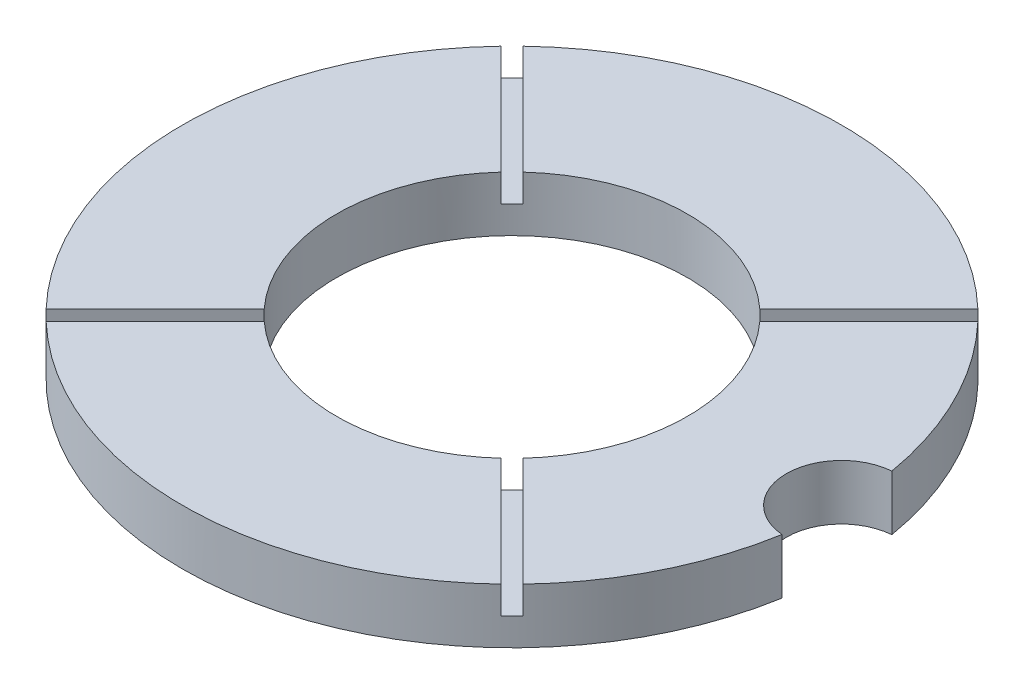
ISO-10303-21;
HEADER;
FILE_DESCRIPTION(('STEP AP214'),'2;1');
FILE_NAME('part.step','',(''),(''),'','','');
FILE_SCHEMA(('AUTOMOTIVE_DESIGN { 1 0 10303 214 1 1 1 1 }'));
ENDSEC;
DATA;
#1=APPLICATION_CONTEXT('core data for automotive mechanical design processes');
#2=APPLICATION_PROTOCOL_DEFINITION('international standard','automotive_design',2000,#1);
#3=PRODUCT_CONTEXT('',#1,'mechanical');
#4=PRODUCT('Part','Part','',(#3));
#5=PRODUCT_RELATED_PRODUCT_CATEGORY('part','',(#4));
#6=PRODUCT_DEFINITION_FORMATION('','',#4);
#7=PRODUCT_DEFINITION_CONTEXT('part definition',#1,'design');
#8=PRODUCT_DEFINITION('design','',#6,#7);
#9=PRODUCT_DEFINITION_SHAPE('','',#8);
#10=(LENGTH_UNIT() NAMED_UNIT(*) SI_UNIT(.MILLI.,.METRE.));
#11=(NAMED_UNIT(*) PLANE_ANGLE_UNIT() SI_UNIT($,.RADIAN.));
#12=(NAMED_UNIT(*) SI_UNIT($,.STERADIAN.) SOLID_ANGLE_UNIT());
#13=UNCERTAINTY_MEASURE_WITH_UNIT(LENGTH_MEASURE(1.E-05),#10,'distance_accuracy_value','');
#14=(GEOMETRIC_REPRESENTATION_CONTEXT(3) GLOBAL_UNCERTAINTY_ASSIGNED_CONTEXT((#13)) GLOBAL_UNIT_ASSIGNED_CONTEXT((#10,
#11,#12)) REPRESENTATION_CONTEXT('',''));
#15=CARTESIAN_POINT('',(0.,0.,0.));
#16=DIRECTION('',(0.,0.,1.));
#17=DIRECTION('',(1.,0.,0.));
#18=AXIS2_PLACEMENT_3D('',#15,#16,#17);
#19=CARTESIAN_POINT('',(0.,12.7,0.));
#20=DIRECTION('',(0.,1.,0.));
#21=DIRECTION('',(0.,0.,1.));
#22=AXIS2_PLACEMENT_3D('',#19,#20,#21);
#23=PLANE('',#22);
#24=DIRECTION('',(0.707106781186543,0.,-0.707106781186552));
#25=VECTOR('',#24,1.);
#26=CARTESIAN_POINT('',(-25.7014930184937,12.7,28.1800437079154));
#27=LINE('',#26,#25);
#28=CARTESIAN_POINT('',(-52.4303897259785,12.7,54.9089404154006));
#29=VERTEX_POINT('',#28);
#30=CARTESIAN_POINT('',(-27.3090139490453,12.7,29.787564638467));
#31=VERTEX_POINT('',#30);
#32=EDGE_CURVE('E235',#29,#31,#27,.T.);
#33=ORIENTED_EDGE('',*,*,#32,.F.);
#34=CARTESIAN_POINT('',(0.,12.7,0.));
#35=DIRECTION('',(0.,1.,0.));
#36=DIRECTION('',(0.,0.,1.));
#37=AXIS2_PLACEMENT_3D('',#34,#35,#36);
#38=CIRCLE('',#37,75.9206);
#39=CARTESIAN_POINT('',(52.4303897259886,12.7,54.9089404153909));
#40=VERTEX_POINT('',#39);
#41=EDGE_CURVE('E191',#29,#40,#38,.T.);
#42=ORIENTED_EDGE('',*,*,#41,.T.);
#43=DIRECTION('',(0.707106781186552,0.,0.707106781186543));
#44=VECTOR('',#43,1.);
#45=CARTESIAN_POINT('',(25.7014930185064,12.7,28.180043707909));
#46=LINE('',#45,#44);
#47=CARTESIAN_POINT('',(27.3090139490553,12.7,29.7875646384578));
#48=VERTEX_POINT('',#47);
#49=EDGE_CURVE('E294',#48,#40,#46,.T.);
#50=ORIENTED_EDGE('',*,*,#49,.F.);
#51=CARTESIAN_POINT('',(0.,12.7,0.));
#52=DIRECTION('',(0.,1.,0.));
#53=DIRECTION('',(0.,0.,1.));
#54=AXIS2_PLACEMENT_3D('',#51,#52,#53);
#55=CIRCLE('',#54,40.4114);
#56=EDGE_CURVE('E242',#31,#48,#55,.T.);
#57=ORIENTED_EDGE('',*,*,#56,.F.);
#58=EDGE_LOOP('',(#33,#42,#50,#57));
#59=FACE_BOUND('',#58,.T.);
#60=ADVANCED_FACE('F38',(#59),#23,.T.);
#61=DIRECTION('',(-0.707106781186552,0.,-0.707106781186543));
#62=VECTOR('',#61,1.);
#63=CARTESIAN_POINT('',(28.1800437079215,12.7,25.7014930184939));
#64=LINE('',#63,#62);
#65=CARTESIAN_POINT('',(54.9089404154034,12.7,52.4303897259755));
#66=VERTEX_POINT('',#65);
#67=CARTESIAN_POINT('',(29.7875646384698,12.7,27.3090139490422));
#68=VERTEX_POINT('',#67);
#69=EDGE_CURVE('E297',#66,#68,#64,.T.);
#70=ORIENTED_EDGE('',*,*,#69,.F.);
#71=CARTESIAN_POINT('',(74.8583718300435,12.7,12.6554996469895));
#72=VERTEX_POINT('',#71);
#73=EDGE_CURVE('E196',#66,#72,#38,.T.);
#74=ORIENTED_EDGE('',*,*,#73,.T.);
#75=CARTESIAN_POINT('',(75.9206,12.7,0.));
#76=DIRECTION('',(0.,1.,0.));
#77=DIRECTION('',(0.,0.,1.));
#78=AXIS2_PLACEMENT_3D('',#75,#76,#77);
#79=CIRCLE('',#78,12.7);
#80=CARTESIAN_POINT('',(74.8583718300435,12.7,-12.6554996469895));
#81=VERTEX_POINT('',#80);
#82=EDGE_CURVE('E252',#81,#72,#79,.T.);
#83=ORIENTED_EDGE('',*,*,#82,.F.);
#84=CARTESIAN_POINT('',(54.908940415394,12.7,-52.4303897259854));
#85=VERTEX_POINT('',#84);
#86=EDGE_CURVE('E194',#81,#85,#38,.T.);
#87=ORIENTED_EDGE('',*,*,#86,.T.);
#88=DIRECTION('',(0.707106781186543,0.,-0.707106781186552));
#89=VECTOR('',#88,1.);
#90=CARTESIAN_POINT('',(28.1800437079151,12.7,-25.7014930185062));
#91=LINE('',#90,#89);
#92=CARTESIAN_POINT('',(29.7875646384609,12.7,-27.309013949052));
#93=VERTEX_POINT('',#92);
#94=EDGE_CURVE('E303',#93,#85,#91,.T.);
#95=ORIENTED_EDGE('',*,*,#94,.F.);
#96=EDGE_CURVE('E206',#68,#93,#55,.T.);
#97=ORIENTED_EDGE('',*,*,#96,.F.);
#98=EDGE_LOOP('',(#70,#74,#83,#87,#95,#97));
#99=FACE_BOUND('',#98,.T.);
#100=ADVANCED_FACE('F319',(#99),#23,.T.);
#101=DIRECTION('',(-0.707106781186543,0.,0.707106781186552));
#102=VECTOR('',#101,1.);
#103=CARTESIAN_POINT('',(25.7014930185,12.7,-28.1800437079212));
#104=LINE('',#103,#102);
#105=CARTESIAN_POINT('',(52.4303897259788,12.7,-54.9089404154003));
#106=VERTEX_POINT('',#105);
#107=CARTESIAN_POINT('',(27.3090139490455,12.7,-29.7875646384668));
#108=VERTEX_POINT('',#107);
#109=EDGE_CURVE('E184',#106,#108,#104,.T.);
#110=ORIENTED_EDGE('',*,*,#109,.F.);
#111=CARTESIAN_POINT('',(-52.4303897259824,12.7,-54.9089404153968));
#112=VERTEX_POINT('',#111);
#113=EDGE_CURVE('E190',#106,#112,#38,.T.);
#114=ORIENTED_EDGE('',*,*,#113,.T.);
#115=DIRECTION('',(-0.707106781186552,0.,-0.707106781186544));
#116=VECTOR('',#115,1.);
#117=CARTESIAN_POINT('',(-25.7014930185001,12.7,-28.1800437079149));
#118=LINE('',#117,#116);
#119=CARTESIAN_POINT('',(-27.3090139490489,12.7,-29.7875646384637));
#120=VERTEX_POINT('',#119);
#121=EDGE_CURVE('E183',#120,#112,#118,.T.);
#122=ORIENTED_EDGE('',*,*,#121,.F.);
#123=EDGE_CURVE('E241',#108,#120,#55,.T.);
#124=ORIENTED_EDGE('',*,*,#123,.F.);
#125=EDGE_LOOP('',(#110,#114,#122,#124));
#126=FACE_BOUND('',#125,.T.);
#127=ADVANCED_FACE('F334',(#126),#23,.T.);
#128=CARTESIAN_POINT('',(0.,12.7,0.));
#129=DIRECTION('',(0.,-1.,0.));
#130=DIRECTION('',(0.,0.,-1.));
#131=AXIS2_PLACEMENT_3D('',#128,#129,#130);
#132=CYLINDRICAL_SURFACE('',#131,75.9206);
#133=ORIENTED_EDGE('',*,*,#41,.F.);
#134=DIRECTION('',(0.,-1.,0.));
#135=VECTOR('',#134,1.);
#136=CARTESIAN_POINT('',(-52.4303897259785,12.7,54.9089404154006));
#137=LINE('',#136,#135);
#138=CARTESIAN_POINT('',(-52.4303897259785,6.35,54.9089404154005));
#139=VERTEX_POINT('',#138);
#140=EDGE_CURVE('E255',#29,#139,#137,.T.);
#141=ORIENTED_EDGE('',*,*,#140,.T.);
#142=CARTESIAN_POINT('',(0.,6.35,0.));
#143=DIRECTION('',(0.,-1.,0.));
#144=DIRECTION('',(0.,0.,-1.));
#145=AXIS2_PLACEMENT_3D('',#142,#143,#144);
#146=CIRCLE('',#145,75.9206);
#147=CARTESIAN_POINT('',(-54.9089404153937,6.35,52.4303897259856));
#148=VERTEX_POINT('',#147);
#149=EDGE_CURVE('E261',#139,#148,#146,.T.);
#150=ORIENTED_EDGE('',*,*,#149,.T.);
#151=DIRECTION('',(0.,-1.,0.));
#152=VECTOR('',#151,1.);
#153=CARTESIAN_POINT('',(-54.9089404153937,12.7,52.4303897259856));
#154=LINE('',#153,#152);
#155=CARTESIAN_POINT('',(-54.9089404153937,12.7,52.4303897259856));
#156=VERTEX_POINT('',#155);
#157=EDGE_CURVE('E189',#148,#156,#154,.F.);
#158=ORIENTED_EDGE('',*,*,#157,.T.);
#159=CARTESIAN_POINT('',(-54.9089404153974,12.7,-52.4303897259818));
#160=VERTEX_POINT('',#159);
#161=EDGE_CURVE('E180',#160,#156,#38,.T.);
#162=ORIENTED_EDGE('',*,*,#161,.F.);
#163=DIRECTION('',(0.,-1.,0.));
#164=VECTOR('',#163,1.);
#165=CARTESIAN_POINT('',(-54.9089404153974,12.7,-52.4303897259817));
#166=LINE('',#165,#164);
#167=CARTESIAN_POINT('',(-54.9089404153974,6.35,-52.4303897259817));
#168=VERTEX_POINT('',#167);
#169=EDGE_CURVE('E162',#160,#168,#166,.T.);
#170=ORIENTED_EDGE('',*,*,#169,.T.);
#171=CARTESIAN_POINT('',(0.,6.35,0.));
#172=DIRECTION('',(0.,-1.,0.));
#173=DIRECTION('',(0.,0.,-1.));
#174=AXIS2_PLACEMENT_3D('',#171,#172,#173);
#175=CIRCLE('',#174,75.9206);
#176=CARTESIAN_POINT('',(-52.4303897259824,6.35,-54.9089404153968));
#177=VERTEX_POINT('',#176);
#178=EDGE_CURVE('E282',#168,#177,#175,.T.);
#179=ORIENTED_EDGE('',*,*,#178,.T.);
#180=DIRECTION('',(0.,-1.,0.));
#181=VECTOR('',#180,1.);
#182=CARTESIAN_POINT('',(-52.4303897259824,12.7,-54.9089404153968));
#183=LINE('',#182,#181);
#184=EDGE_CURVE('E173',#177,#112,#183,.F.);
#185=ORIENTED_EDGE('',*,*,#184,.T.);
#186=ORIENTED_EDGE('',*,*,#113,.F.);
#187=DIRECTION('',(0.,-1.,0.));
#188=VECTOR('',#187,1.);
#189=CARTESIAN_POINT('',(52.4303897259787,12.7,-54.9089404154003));
#190=LINE('',#189,#188);
#191=CARTESIAN_POINT('',(52.4303897259788,6.35,-54.9089404154003));
#192=VERTEX_POINT('',#191);
#193=EDGE_CURVE('E272',#106,#192,#190,.T.);
#194=ORIENTED_EDGE('',*,*,#193,.T.);
#195=CARTESIAN_POINT('',(0.,6.35,0.));
#196=DIRECTION('',(0.,-1.,0.));
#197=DIRECTION('',(0.,0.,-1.));
#198=AXIS2_PLACEMENT_3D('',#195,#196,#197);
#199=CIRCLE('',#198,75.9206);
#200=CARTESIAN_POINT('',(54.908940415394,6.35,-52.4303897259854));
#201=VERTEX_POINT('',#200);
#202=EDGE_CURVE('E172',#192,#201,#199,.T.);
#203=ORIENTED_EDGE('',*,*,#202,.T.);
#204=DIRECTION('',(0.,-1.,0.));
#205=VECTOR('',#204,1.);
#206=CARTESIAN_POINT('',(54.908940415394,12.7,-52.4303897259854));
#207=LINE('',#206,#205);
#208=EDGE_CURVE('E275',#201,#85,#207,.F.);
#209=ORIENTED_EDGE('',*,*,#208,.T.);
#210=ORIENTED_EDGE('',*,*,#86,.F.);
#211=DIRECTION('',(0.,1.,0.));
#212=VECTOR('',#211,1.);
#213=CARTESIAN_POINT('',(74.8583718300435,0.,-12.6554996469895));
#214=LINE('',#213,#212);
#215=CARTESIAN_POINT('',(74.8583718300435,0.,-12.6554996469895));
#216=VERTEX_POINT('',#215);
#217=EDGE_CURVE('E246',#216,#81,#214,.T.);
#218=ORIENTED_EDGE('',*,*,#217,.F.);
#219=CARTESIAN_POINT('',(0.,0.,0.));
#220=DIRECTION('',(0.,1.,0.));
#221=DIRECTION('',(0.,0.,1.));
#222=AXIS2_PLACEMENT_3D('',#219,#220,#221);
#223=CIRCLE('',#222,75.9206);
#224=CARTESIAN_POINT('',(74.8583718300435,0.,12.6554996469895));
#225=VERTEX_POINT('',#224);
#226=EDGE_CURVE('E203',#216,#225,#223,.T.);
#227=ORIENTED_EDGE('',*,*,#226,.T.);
#228=DIRECTION('',(0.,1.,0.));
#229=VECTOR('',#228,1.);
#230=CARTESIAN_POINT('',(74.8583718300435,0.,12.6554996469895));
#231=LINE('',#230,#229);
#232=EDGE_CURVE('E248',#225,#72,#231,.T.);
#233=ORIENTED_EDGE('',*,*,#232,.T.);
#234=ORIENTED_EDGE('',*,*,#73,.F.);
#235=DIRECTION('',(0.,-1.,0.));
#236=VECTOR('',#235,1.);
#237=CARTESIAN_POINT('',(54.9089404154034,12.7,52.4303897259755));
#238=LINE('',#237,#236);
#239=CARTESIAN_POINT('',(54.9089404154034,6.35,52.4303897259755));
#240=VERTEX_POINT('',#239);
#241=EDGE_CURVE('E263',#66,#240,#238,.T.);
#242=ORIENTED_EDGE('',*,*,#241,.T.);
#243=CARTESIAN_POINT('',(0.,6.35,0.));
#244=DIRECTION('',(0.,-1.,0.));
#245=DIRECTION('',(0.,0.,-1.));
#246=AXIS2_PLACEMENT_3D('',#243,#244,#245);
#247=CIRCLE('',#246,75.9206);
#248=CARTESIAN_POINT('',(52.4303897259886,6.35,54.9089404153909));
#249=VERTEX_POINT('',#248);
#250=EDGE_CURVE('E269',#240,#249,#247,.T.);
#251=ORIENTED_EDGE('',*,*,#250,.T.);
#252=DIRECTION('',(0.,-1.,0.));
#253=VECTOR('',#252,1.);
#254=CARTESIAN_POINT('',(52.4303897259886,12.7,54.9089404153909));
#255=LINE('',#254,#253);
#256=EDGE_CURVE('E266',#249,#40,#255,.F.);
#257=ORIENTED_EDGE('',*,*,#256,.T.);
#258=EDGE_LOOP('',(#133,#141,#150,#158,#162,#170,#179,#185,#186,#194,#203,#209,#210,#218,#227,
#233,#234,#242,#251,#257));
#259=FACE_BOUND('',#258,.T.);
#260=ADVANCED_FACE('F40',(#259),#132,.T.);
#261=DIRECTION('',(-0.707106781186543,0.,0.707106781186552));
#262=VECTOR('',#261,1.);
#263=CARTESIAN_POINT('',(-28.1800437079088,12.7,25.7014930185003));
#264=LINE('',#263,#262);
#265=CARTESIAN_POINT('',(-29.7875646384606,12.7,27.3090139490522));
#266=VERTEX_POINT('',#265);
#267=EDGE_CURVE('E230',#266,#156,#264,.T.);
#268=ORIENTED_EDGE('',*,*,#267,.F.);
#269=CARTESIAN_POINT('',(-29.787564638464,12.7,-27.3090139490486));
#270=VERTEX_POINT('',#269);
#271=EDGE_CURVE('E182',#270,#266,#55,.T.);
#272=ORIENTED_EDGE('',*,*,#271,.F.);
#273=DIRECTION('',(0.707106781186552,0.,0.707106781186543));
#274=VECTOR('',#273,1.);
#275=CARTESIAN_POINT('',(-28.1800437079151,12.7,-25.7014930184998));
#276=LINE('',#275,#274);
#277=EDGE_CURVE('E166',#160,#270,#276,.T.);
#278=ORIENTED_EDGE('',*,*,#277,.F.);
#279=ORIENTED_EDGE('',*,*,#161,.T.);
#280=EDGE_LOOP('',(#268,#272,#278,#279));
#281=FACE_BOUND('',#280,.T.);
#282=ADVANCED_FACE('F179',(#281),#23,.T.);
#283=CARTESIAN_POINT('',(0.,0.,0.));
#284=DIRECTION('',(0.,1.,0.));
#285=DIRECTION('',(0.,0.,1.));
#286=AXIS2_PLACEMENT_3D('',#283,#284,#285);
#287=PLANE('',#286);
#288=CARTESIAN_POINT('',(0.,0.,0.));
#289=DIRECTION('',(0.,1.,0.));
#290=DIRECTION('',(0.,0.,1.));
#291=AXIS2_PLACEMENT_3D('',#288,#289,#290);
#292=CIRCLE('',#291,40.4114);
#293=CARTESIAN_POINT('',(0.,0.,40.4114));
#294=VERTEX_POINT('',#293);
#295=EDGE_CURVE('E201',#294,#294,#292,.T.);
#296=ORIENTED_EDGE('',*,*,#295,.T.);
#297=EDGE_LOOP('',(#296));
#298=FACE_BOUND('',#297,.T.);
#299=ORIENTED_EDGE('',*,*,#226,.F.);
#300=CARTESIAN_POINT('',(75.9206,0.,0.));
#301=DIRECTION('',(0.,1.,0.));
#302=DIRECTION('',(0.,0.,1.));
#303=AXIS2_PLACEMENT_3D('',#300,#301,#302);
#304=CIRCLE('',#303,12.7);
#305=EDGE_CURVE('E249',#216,#225,#304,.T.);
#306=ORIENTED_EDGE('',*,*,#305,.T.);
#307=EDGE_LOOP('',(#299,#306));
#308=FACE_BOUND('',#307,.T.);
#309=ADVANCED_FACE('F325',(#298,#308),#287,.F.);
#310=CARTESIAN_POINT('',(0.,12.7,0.));
#311=DIRECTION('',(0.,-1.,0.));
#312=DIRECTION('',(0.,0.,-1.));
#313=AXIS2_PLACEMENT_3D('',#310,#311,#312);
#314=CYLINDRICAL_SURFACE('',#313,40.4114);
#315=DIRECTION('',(0.,-1.,0.));
#316=VECTOR('',#315,1.);
#317=CARTESIAN_POINT('',(-27.3090139490453,12.7,29.787564638467));
#318=LINE('',#317,#316);
#319=CARTESIAN_POINT('',(-27.3090139490453,6.35,29.787564638467));
#320=VERTEX_POINT('',#319);
#321=EDGE_CURVE('E11',#31,#320,#318,.T.);
#322=ORIENTED_EDGE('',*,*,#321,.F.);
#323=ORIENTED_EDGE('',*,*,#56,.T.);
#324=DIRECTION('',(0.,-1.,0.));
#325=VECTOR('',#324,1.);
#326=CARTESIAN_POINT('',(27.3090139490553,12.7,29.7875646384578));
#327=LINE('',#326,#325);
#328=CARTESIAN_POINT('',(27.3090139490553,6.35,29.7875646384578));
#329=VERTEX_POINT('',#328);
#330=EDGE_CURVE('E221',#329,#48,#327,.F.);
#331=ORIENTED_EDGE('',*,*,#330,.F.);
#332=CARTESIAN_POINT('',(0.,6.35,0.));
#333=DIRECTION('',(0.,-1.,0.));
#334=DIRECTION('',(0.,0.,-1.));
#335=AXIS2_PLACEMENT_3D('',#332,#333,#334);
#336=CIRCLE('',#335,40.4114);
#337=CARTESIAN_POINT('',(29.7875646384698,6.35,27.3090139490422));
#338=VERTEX_POINT('',#337);
#339=EDGE_CURVE('E219',#338,#329,#336,.T.);
#340=ORIENTED_EDGE('',*,*,#339,.F.);
#341=DIRECTION('',(0.,-1.,0.));
#342=VECTOR('',#341,1.);
#343=CARTESIAN_POINT('',(29.7875646384698,12.7,27.3090139490422));
#344=LINE('',#343,#342);
#345=EDGE_CURVE('E223',#68,#338,#344,.T.);
#346=ORIENTED_EDGE('',*,*,#345,.F.);
#347=ORIENTED_EDGE('',*,*,#96,.T.);
#348=DIRECTION('',(0.,-1.,0.));
#349=VECTOR('',#348,1.);
#350=CARTESIAN_POINT('',(29.7875646384609,12.7,-27.309013949052));
#351=LINE('',#350,#349);
#352=CARTESIAN_POINT('',(29.7875646384609,6.35,-27.309013949052));
#353=VERTEX_POINT('',#352);
#354=EDGE_CURVE('E214',#353,#93,#351,.F.);
#355=ORIENTED_EDGE('',*,*,#354,.F.);
#356=CARTESIAN_POINT('',(0.,6.35,0.));
#357=DIRECTION('',(0.,-1.,0.));
#358=DIRECTION('',(0.,0.,-1.));
#359=AXIS2_PLACEMENT_3D('',#356,#357,#358);
#360=CIRCLE('',#359,40.4114);
#361=CARTESIAN_POINT('',(27.3090139490455,6.35,-29.7875646384668));
#362=VERTEX_POINT('',#361);
#363=EDGE_CURVE('E212',#362,#353,#360,.T.);
#364=ORIENTED_EDGE('',*,*,#363,.F.);
#365=DIRECTION('',(0.,-1.,0.));
#366=VECTOR('',#365,1.);
#367=CARTESIAN_POINT('',(27.3090139490455,12.7,-29.7875646384668));
#368=LINE('',#367,#366);
#369=EDGE_CURVE('E216',#108,#362,#368,.T.);
#370=ORIENTED_EDGE('',*,*,#369,.F.);
#371=ORIENTED_EDGE('',*,*,#123,.T.);
#372=DIRECTION('',(0.,-1.,0.));
#373=VECTOR('',#372,1.);
#374=CARTESIAN_POINT('',(-27.3090139490489,12.7,-29.7875646384637));
#375=LINE('',#374,#373);
#376=CARTESIAN_POINT('',(-27.3090139490489,6.35,-29.7875646384637));
#377=VERTEX_POINT('',#376);
#378=EDGE_CURVE('E208',#377,#120,#375,.F.);
#379=ORIENTED_EDGE('',*,*,#378,.F.);
#380=CARTESIAN_POINT('',(0.,6.35,0.));
#381=DIRECTION('',(0.,-1.,0.));
#382=DIRECTION('',(0.,0.,-1.));
#383=AXIS2_PLACEMENT_3D('',#380,#381,#382);
#384=CIRCLE('',#383,40.4114);
#385=CARTESIAN_POINT('',(-29.787564638464,6.35,-27.3090139490486));
#386=VERTEX_POINT('',#385);
#387=EDGE_CURVE('E200',#386,#377,#384,.T.);
#388=ORIENTED_EDGE('',*,*,#387,.F.);
#389=DIRECTION('',(0.,-1.,0.));
#390=VECTOR('',#389,1.);
#391=CARTESIAN_POINT('',(-29.787564638464,12.7,-27.3090139490486));
#392=LINE('',#391,#390);
#393=EDGE_CURVE('E210',#270,#386,#392,.T.);
#394=ORIENTED_EDGE('',*,*,#393,.F.);
#395=ORIENTED_EDGE('',*,*,#271,.T.);
#396=DIRECTION('',(0.,-1.,0.));
#397=VECTOR('',#396,1.);
#398=CARTESIAN_POINT('',(-29.7875646384606,12.7,27.3090139490522));
#399=LINE('',#398,#397);
#400=CARTESIAN_POINT('',(-29.7875646384606,6.35,27.3090139490522));
#401=VERTEX_POINT('',#400);
#402=EDGE_CURVE('E46',#401,#266,#399,.F.);
#403=ORIENTED_EDGE('',*,*,#402,.F.);
#404=CARTESIAN_POINT('',(0.,6.35,0.));
#405=DIRECTION('',(0.,-1.,0.));
#406=DIRECTION('',(0.,0.,-1.));
#407=AXIS2_PLACEMENT_3D('',#404,#405,#406);
#408=CIRCLE('',#407,40.4114);
#409=EDGE_CURVE('E225',#320,#401,#408,.T.);
#410=ORIENTED_EDGE('',*,*,#409,.F.);
#411=EDGE_LOOP('',(#322,#323,#331,#340,#346,#347,#355,#364,#370,#371,#379,#388,#394,#395,#403,#410));
#412=FACE_BOUND('',#411,.T.);
#413=ORIENTED_EDGE('',*,*,#295,.F.);
#414=EDGE_LOOP('',(#413));
#415=FACE_BOUND('',#414,.T.);
#416=ADVANCED_FACE('F238',(#412,#415),#314,.F.);
#417=CARTESIAN_POINT('',(75.9206,0.,0.));
#418=DIRECTION('',(0.,1.,0.));
#419=DIRECTION('',(0.,0.,1.));
#420=AXIS2_PLACEMENT_3D('',#417,#418,#419);
#421=CYLINDRICAL_SURFACE('',#420,12.7);
#422=ORIENTED_EDGE('',*,*,#82,.T.);
#423=ORIENTED_EDGE('',*,*,#232,.F.);
#424=ORIENTED_EDGE('',*,*,#305,.F.);
#425=ORIENTED_EDGE('',*,*,#217,.T.);
#426=EDGE_LOOP('',(#422,#423,#424,#425));
#427=FACE_BOUND('',#426,.T.);
#428=ADVANCED_FACE('F322',(#427),#421,.F.);
#429=CARTESIAN_POINT('',(-28.1800437079151,6.35,-25.7014930184998));
#430=DIRECTION('',(-0.707106781186543,0.,0.707106781186552));
#431=DIRECTION('',(0.707106781186552,0.,0.707106781186543));
#432=AXIS2_PLACEMENT_3D('',#429,#430,#431);
#433=PLANE('',#432);
#434=ORIENTED_EDGE('',*,*,#277,.T.);
#435=ORIENTED_EDGE('',*,*,#393,.T.);
#436=DIRECTION('',(0.707106781186552,0.,0.707106781186543));
#437=VECTOR('',#436,1.);
#438=CARTESIAN_POINT('',(-28.1800437079151,6.35,-25.7014930184998));
#439=LINE('',#438,#437);
#440=EDGE_CURVE('E168',#168,#386,#439,.T.);
#441=ORIENTED_EDGE('',*,*,#440,.F.);
#442=ORIENTED_EDGE('',*,*,#169,.F.);
#443=EDGE_LOOP('',(#434,#435,#441,#442));
#444=FACE_BOUND('',#443,.T.);
#445=ADVANCED_FACE('F164',(#444),#433,.F.);
#446=CARTESIAN_POINT('',(-25.7014930185001,6.35,-28.1800437079149));
#447=DIRECTION('',(0.707106781186543,0.,-0.707106781186551));
#448=DIRECTION('',(-0.707106781186551,0.,-0.707106781186544));
#449=AXIS2_PLACEMENT_3D('',#446,#447,#448);
#450=PLANE('',#449);
#451=DIRECTION('',(-0.707106781186552,0.,-0.707106781186544));
#452=VECTOR('',#451,1.);
#453=CARTESIAN_POINT('',(-25.7014930185001,6.35,-28.1800437079149));
#454=LINE('',#453,#452);
#455=EDGE_CURVE('E284',#377,#177,#454,.T.);
#456=ORIENTED_EDGE('',*,*,#455,.F.);
#457=ORIENTED_EDGE('',*,*,#378,.T.);
#458=ORIENTED_EDGE('',*,*,#121,.T.);
#459=ORIENTED_EDGE('',*,*,#184,.F.);
#460=EDGE_LOOP('',(#456,#457,#458,#459));
#461=FACE_BOUND('',#460,.T.);
#462=ADVANCED_FACE('F347',(#461),#450,.F.);
#463=CARTESIAN_POINT('',(0.,6.35,0.));
#464=DIRECTION('',(0.,-1.,0.));
#465=DIRECTION('',(0.,0.,-1.));
#466=AXIS2_PLACEMENT_3D('',#463,#464,#465);
#467=PLANE('',#466);
#468=ORIENTED_EDGE('',*,*,#440,.T.);
#469=ORIENTED_EDGE('',*,*,#387,.T.);
#470=ORIENTED_EDGE('',*,*,#455,.T.);
#471=ORIENTED_EDGE('',*,*,#178,.F.);
#472=EDGE_LOOP('',(#468,#469,#470,#471));
#473=FACE_BOUND('',#472,.T.);
#474=ADVANCED_FACE('F350',(#473),#467,.F.);
#475=CARTESIAN_POINT('',(25.7014930185,6.35,-28.1800437079212));
#476=DIRECTION('',(-0.707106781186551,0.,-0.707106781186543));
#477=DIRECTION('',(-0.707106781186544,0.,0.707106781186552));
#478=AXIS2_PLACEMENT_3D('',#475,#476,#477);
#479=PLANE('',#478);
#480=ORIENTED_EDGE('',*,*,#109,.T.);
#481=ORIENTED_EDGE('',*,*,#369,.T.);
#482=DIRECTION('',(-0.707106781186543,0.,0.707106781186552));
#483=VECTOR('',#482,1.);
#484=CARTESIAN_POINT('',(25.7014930185,6.35,-28.1800437079212));
#485=LINE('',#484,#483);
#486=EDGE_CURVE('E301',#192,#362,#485,.T.);
#487=ORIENTED_EDGE('',*,*,#486,.F.);
#488=ORIENTED_EDGE('',*,*,#193,.F.);
#489=EDGE_LOOP('',(#480,#481,#487,#488));
#490=FACE_BOUND('',#489,.T.);
#491=ADVANCED_FACE('F354',(#490),#479,.F.);
#492=CARTESIAN_POINT('',(28.1800437079151,6.35,-25.7014930185062));
#493=DIRECTION('',(0.707106781186551,0.,0.707106781186543));
#494=DIRECTION('',(0.707106781186544,0.,-0.707106781186552));
#495=AXIS2_PLACEMENT_3D('',#492,#493,#494);
#496=PLANE('',#495);
#497=DIRECTION('',(0.707106781186543,0.,-0.707106781186552));
#498=VECTOR('',#497,1.);
#499=CARTESIAN_POINT('',(28.1800437079151,6.35,-25.7014930185062));
#500=LINE('',#499,#498);
#501=EDGE_CURVE('E299',#353,#201,#500,.T.);
#502=ORIENTED_EDGE('',*,*,#501,.F.);
#503=ORIENTED_EDGE('',*,*,#354,.T.);
#504=ORIENTED_EDGE('',*,*,#94,.T.);
#505=ORIENTED_EDGE('',*,*,#208,.F.);
#506=EDGE_LOOP('',(#502,#503,#504,#505));
#507=FACE_BOUND('',#506,.T.);
#508=ADVANCED_FACE('F310',(#507),#496,.F.);
#509=CARTESIAN_POINT('',(0.,6.35,0.));
#510=DIRECTION('',(0.,-1.,0.));
#511=DIRECTION('',(0.,0.,-1.));
#512=AXIS2_PLACEMENT_3D('',#509,#510,#511);
#513=PLANE('',#512);
#514=ORIENTED_EDGE('',*,*,#486,.T.);
#515=ORIENTED_EDGE('',*,*,#363,.T.);
#516=ORIENTED_EDGE('',*,*,#501,.T.);
#517=ORIENTED_EDGE('',*,*,#202,.F.);
#518=EDGE_LOOP('',(#514,#515,#516,#517));
#519=FACE_BOUND('',#518,.T.);
#520=ADVANCED_FACE('F375',(#519),#513,.F.);
#521=CARTESIAN_POINT('',(28.1800437079215,6.35,25.7014930184939));
#522=DIRECTION('',(0.707106781186543,0.,-0.707106781186552));
#523=DIRECTION('',(-0.707106781186552,0.,-0.707106781186543));
#524=AXIS2_PLACEMENT_3D('',#521,#522,#523);
#525=PLANE('',#524);
#526=ORIENTED_EDGE('',*,*,#69,.T.);
#527=ORIENTED_EDGE('',*,*,#345,.T.);
#528=DIRECTION('',(-0.707106781186552,0.,-0.707106781186543));
#529=VECTOR('',#528,1.);
#530=CARTESIAN_POINT('',(28.1800437079215,6.35,25.7014930184939));
#531=LINE('',#530,#529);
#532=EDGE_CURVE('E60',#240,#338,#531,.T.);
#533=ORIENTED_EDGE('',*,*,#532,.F.);
#534=ORIENTED_EDGE('',*,*,#241,.F.);
#535=EDGE_LOOP('',(#526,#527,#533,#534));
#536=FACE_BOUND('',#535,.T.);
#537=ADVANCED_FACE('F371',(#536),#525,.F.);
#538=CARTESIAN_POINT('',(25.7014930185064,6.35,28.180043707909));
#539=DIRECTION('',(-0.707106781186543,0.,0.707106781186552));
#540=DIRECTION('',(0.707106781186552,0.,0.707106781186543));
#541=AXIS2_PLACEMENT_3D('',#538,#539,#540);
#542=PLANE('',#541);
#543=DIRECTION('',(0.707106781186552,0.,0.707106781186543));
#544=VECTOR('',#543,1.);
#545=CARTESIAN_POINT('',(25.7014930185064,6.35,28.180043707909));
#546=LINE('',#545,#544);
#547=EDGE_CURVE('E291',#329,#249,#546,.T.);
#548=ORIENTED_EDGE('',*,*,#547,.F.);
#549=ORIENTED_EDGE('',*,*,#330,.T.);
#550=ORIENTED_EDGE('',*,*,#49,.T.);
#551=ORIENTED_EDGE('',*,*,#256,.F.);
#552=EDGE_LOOP('',(#548,#549,#550,#551));
#553=FACE_BOUND('',#552,.T.);
#554=ADVANCED_FACE('F368',(#553),#542,.F.);
#555=CARTESIAN_POINT('',(0.,6.35,0.));
#556=DIRECTION('',(0.,-1.,0.));
#557=DIRECTION('',(0.,0.,-1.));
#558=AXIS2_PLACEMENT_3D('',#555,#556,#557);
#559=PLANE('',#558);
#560=ORIENTED_EDGE('',*,*,#532,.T.);
#561=ORIENTED_EDGE('',*,*,#339,.T.);
#562=ORIENTED_EDGE('',*,*,#547,.T.);
#563=ORIENTED_EDGE('',*,*,#250,.F.);
#564=EDGE_LOOP('',(#560,#561,#562,#563));
#565=FACE_BOUND('',#564,.T.);
#566=ADVANCED_FACE('F364',(#565),#559,.F.);
#567=CARTESIAN_POINT('',(-25.7014930184937,6.35,28.1800437079154));
#568=DIRECTION('',(0.707106781186552,0.,0.707106781186543));
#569=DIRECTION('',(0.707106781186543,0.,-0.707106781186552));
#570=AXIS2_PLACEMENT_3D('',#567,#568,#569);
#571=PLANE('',#570);
#572=ORIENTED_EDGE('',*,*,#32,.T.);
#573=ORIENTED_EDGE('',*,*,#321,.T.);
#574=DIRECTION('',(0.707106781186543,0.,-0.707106781186552));
#575=VECTOR('',#574,1.);
#576=CARTESIAN_POINT('',(-25.7014930184937,6.35,28.1800437079154));
#577=LINE('',#576,#575);
#578=EDGE_CURVE('E53',#139,#320,#577,.T.);
#579=ORIENTED_EDGE('',*,*,#578,.F.);
#580=ORIENTED_EDGE('',*,*,#140,.F.);
#581=EDGE_LOOP('',(#572,#573,#579,#580));
#582=FACE_BOUND('',#581,.T.);
#583=ADVANCED_FACE('F361',(#582),#571,.F.);
#584=CARTESIAN_POINT('',(-28.1800437079088,6.35,25.7014930185003));
#585=DIRECTION('',(-0.707106781186552,0.,-0.707106781186543));
#586=DIRECTION('',(-0.707106781186543,0.,0.707106781186552));
#587=AXIS2_PLACEMENT_3D('',#584,#585,#586);
#588=PLANE('',#587);
#589=DIRECTION('',(-0.707106781186543,0.,0.707106781186552));
#590=VECTOR('',#589,1.);
#591=CARTESIAN_POINT('',(-28.1800437079088,6.35,25.7014930185003));
#592=LINE('',#591,#590);
#593=EDGE_CURVE('E232',#401,#148,#592,.T.);
#594=ORIENTED_EDGE('',*,*,#593,.F.);
#595=ORIENTED_EDGE('',*,*,#402,.T.);
#596=ORIENTED_EDGE('',*,*,#267,.T.);
#597=ORIENTED_EDGE('',*,*,#157,.F.);
#598=EDGE_LOOP('',(#594,#595,#596,#597));
#599=FACE_BOUND('',#598,.T.);
#600=ADVANCED_FACE('F229',(#599),#588,.F.);
#601=CARTESIAN_POINT('',(0.,6.35,0.));
#602=DIRECTION('',(0.,-1.,0.));
#603=DIRECTION('',(0.,0.,-1.));
#604=AXIS2_PLACEMENT_3D('',#601,#602,#603);
#605=PLANE('',#604);
#606=ORIENTED_EDGE('',*,*,#578,.T.);
#607=ORIENTED_EDGE('',*,*,#409,.T.);
#608=ORIENTED_EDGE('',*,*,#593,.T.);
#609=ORIENTED_EDGE('',*,*,#149,.F.);
#610=EDGE_LOOP('',(#606,#607,#608,#609));
#611=FACE_BOUND('',#610,.T.);
#612=ADVANCED_FACE('F356',(#611),#605,.F.);
#613=CLOSED_SHELL('',(#60,#100,#127,#260,#282,#309,#416,#428,#445,#462,#474,#491,#508,#520,#537,
#554,#566,#583,#600,#612));
#614=MANIFOLD_SOLID_BREP('B2',#613);
#615=ADVANCED_BREP_SHAPE_REPRESENTATION('',(#18,#614),#14);
#616=SHAPE_DEFINITION_REPRESENTATION(#9,#615);
ENDSEC;
END-ISO-10303-21;
